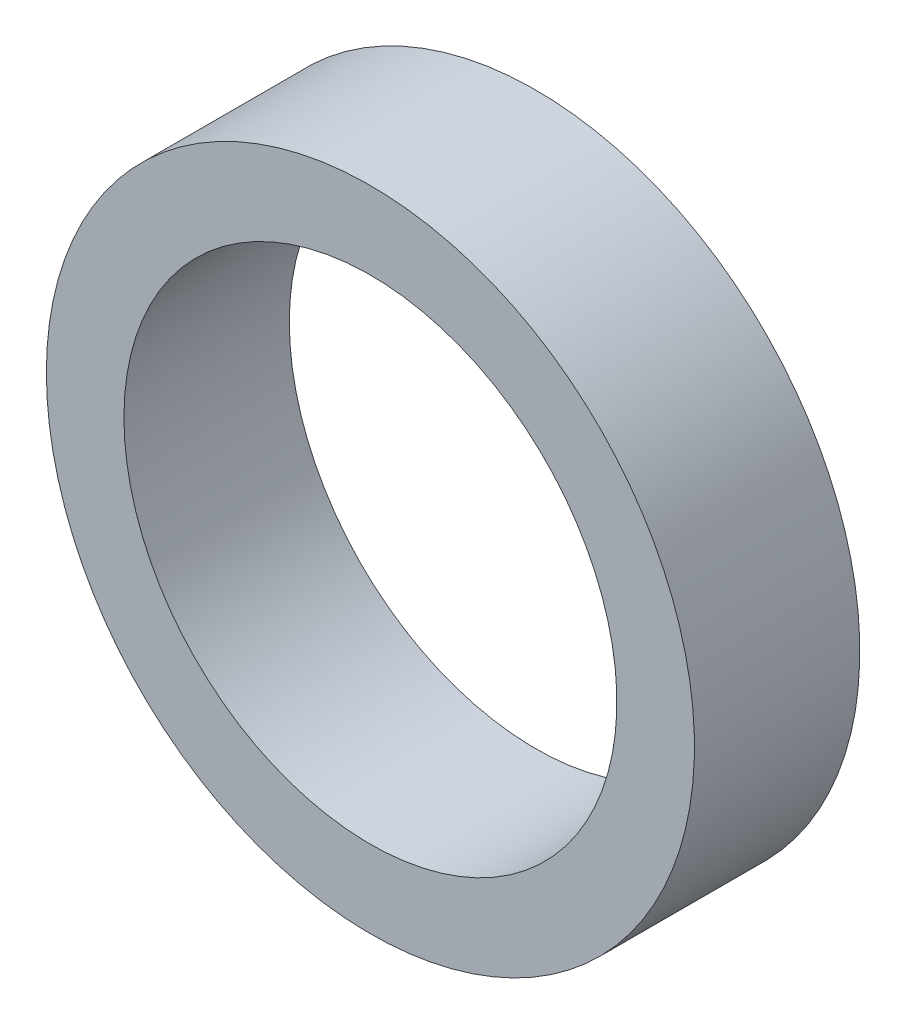
ISO-10303-21;
HEADER;
FILE_DESCRIPTION(('STEP AP214'),'2;1');
FILE_NAME('part.step','',(''),(''),'','','');
FILE_SCHEMA(('AUTOMOTIVE_DESIGN { 1 0 10303 214 1 1 1 1 }'));
ENDSEC;
DATA;
#1=APPLICATION_CONTEXT('core data for automotive mechanical design processes');
#2=APPLICATION_PROTOCOL_DEFINITION('international standard','automotive_design',2000,#1);
#3=PRODUCT_CONTEXT('',#1,'mechanical');
#4=PRODUCT('Part','Part','',(#3));
#5=PRODUCT_RELATED_PRODUCT_CATEGORY('part','',(#4));
#6=PRODUCT_DEFINITION_FORMATION('','',#4);
#7=PRODUCT_DEFINITION_CONTEXT('part definition',#1,'design');
#8=PRODUCT_DEFINITION('design','',#6,#7);
#9=PRODUCT_DEFINITION_SHAPE('','',#8);
#10=(LENGTH_UNIT() NAMED_UNIT(*) SI_UNIT(.MILLI.,.METRE.));
#11=(NAMED_UNIT(*) PLANE_ANGLE_UNIT() SI_UNIT($,.RADIAN.));
#12=(NAMED_UNIT(*) SI_UNIT($,.STERADIAN.) SOLID_ANGLE_UNIT());
#13=UNCERTAINTY_MEASURE_WITH_UNIT(LENGTH_MEASURE(1.E-05),#10,'distance_accuracy_value','');
#14=(GEOMETRIC_REPRESENTATION_CONTEXT(3) GLOBAL_UNCERTAINTY_ASSIGNED_CONTEXT((#13)) GLOBAL_UNIT_ASSIGNED_CONTEXT((#10,
#11,#12)) REPRESENTATION_CONTEXT('',''));
#15=CARTESIAN_POINT('',(0.,0.,0.));
#16=DIRECTION('',(0.,0.,1.));
#17=DIRECTION('',(1.,0.,0.));
#18=AXIS2_PLACEMENT_3D('',#15,#16,#17);
#19=CARTESIAN_POINT('',(16.,16.,9.68));
#20=DIRECTION('',(0.,0.,-1.));
#21=DIRECTION('',(-1.,0.,0.));
#22=AXIS2_PLACEMENT_3D('',#19,#20,#21);
#23=CYLINDRICAL_SURFACE('',#22,1.8928132);
#24=CARTESIAN_POINT('',(16.,16.,10.95));
#25=DIRECTION('',(0.,0.,-1.));
#26=DIRECTION('',(-1.,0.,0.));
#27=AXIS2_PLACEMENT_3D('',#24,#25,#26);
#28=CIRCLE('',#27,1.8928132);
#29=CARTESIAN_POINT('',(14.1071868,16.,10.95));
#30=VERTEX_POINT('',#29);
#31=EDGE_CURVE('E27',#30,#30,#28,.T.);
#32=ORIENTED_EDGE('',*,*,#31,.F.);
#33=EDGE_LOOP('',(#32));
#34=FACE_BOUND('',#33,.T.);
#35=CARTESIAN_POINT('',(16.,16.,9.68));
#36=DIRECTION('',(0.,0.,-1.));
#37=DIRECTION('',(-1.,0.,0.));
#38=AXIS2_PLACEMENT_3D('',#35,#36,#37);
#39=CIRCLE('',#38,1.8928132);
#40=CARTESIAN_POINT('',(14.1071868,16.,9.68));
#41=VERTEX_POINT('',#40);
#42=EDGE_CURVE('E18',#41,#41,#39,.T.);
#43=ORIENTED_EDGE('',*,*,#42,.T.);
#44=EDGE_LOOP('',(#43));
#45=FACE_BOUND('',#44,.T.);
#46=ADVANCED_FACE('F15',(#34,#45),#23,.F.);
#47=CARTESIAN_POINT('',(28.00000000001,16.000000000005,9.68));
#48=DIRECTION('',(0.,0.,1.));
#49=DIRECTION('',(1.,0.,0.));
#50=AXIS2_PLACEMENT_3D('',#47,#48,#49);
#51=PLANE('',#50);
#52=CARTESIAN_POINT('',(16.,16.,9.68));
#53=DIRECTION('',(0.,0.,-1.));
#54=DIRECTION('',(-1.,0.,0.));
#55=AXIS2_PLACEMENT_3D('',#52,#53,#54);
#56=CIRCLE('',#55,2.4883755);
#57=CARTESIAN_POINT('',(13.5116245,16.,9.68));
#58=VERTEX_POINT('',#57);
#59=EDGE_CURVE('E22',#58,#58,#56,.F.);
#60=ORIENTED_EDGE('',*,*,#59,.F.);
#61=EDGE_LOOP('',(#60));
#62=FACE_BOUND('',#61,.T.);
#63=ORIENTED_EDGE('',*,*,#42,.F.);
#64=EDGE_LOOP('',(#63));
#65=FACE_BOUND('',#64,.T.);
#66=ADVANCED_FACE('F36',(#62,#65),#51,.F.);
#67=CARTESIAN_POINT('',(28.00000000001,16.000000000005,10.95));
#68=DIRECTION('',(0.,0.,1.));
#69=DIRECTION('',(1.,0.,0.));
#70=AXIS2_PLACEMENT_3D('',#67,#68,#69);
#71=PLANE('',#70);
#72=CARTESIAN_POINT('',(16.,16.,10.95));
#73=DIRECTION('',(0.,0.,-1.));
#74=DIRECTION('',(-1.,0.,0.));
#75=AXIS2_PLACEMENT_3D('',#72,#73,#74);
#76=CIRCLE('',#75,2.4883755);
#77=CARTESIAN_POINT('',(13.5116245,16.,10.95));
#78=VERTEX_POINT('',#77);
#79=EDGE_CURVE('E10',#78,#78,#76,.T.);
#80=ORIENTED_EDGE('',*,*,#79,.F.);
#81=EDGE_LOOP('',(#80));
#82=FACE_BOUND('',#81,.T.);
#83=ORIENTED_EDGE('',*,*,#31,.T.);
#84=EDGE_LOOP('',(#83));
#85=FACE_BOUND('',#84,.T.);
#86=ADVANCED_FACE('F38',(#82,#85),#71,.T.);
#87=CARTESIAN_POINT('',(16.,16.,9.68));
#88=DIRECTION('',(0.,0.,-1.));
#89=DIRECTION('',(-1.,0.,0.));
#90=AXIS2_PLACEMENT_3D('',#87,#88,#89);
#91=CYLINDRICAL_SURFACE('',#90,2.4883755);
#92=ORIENTED_EDGE('',*,*,#79,.T.);
#93=EDGE_LOOP('',(#92));
#94=FACE_BOUND('',#93,.T.);
#95=ORIENTED_EDGE('',*,*,#59,.T.);
#96=EDGE_LOOP('',(#95));
#97=FACE_BOUND('',#96,.T.);
#98=ADVANCED_FACE('F45',(#94,#97),#91,.T.);
#99=CLOSED_SHELL('',(#46,#66,#86,#98));
#100=MANIFOLD_SOLID_BREP('B1',#99);
#101=ADVANCED_BREP_SHAPE_REPRESENTATION('',(#18,#100),#14);
#102=SHAPE_DEFINITION_REPRESENTATION(#9,#101);
ENDSEC;
END-ISO-10303-21;
